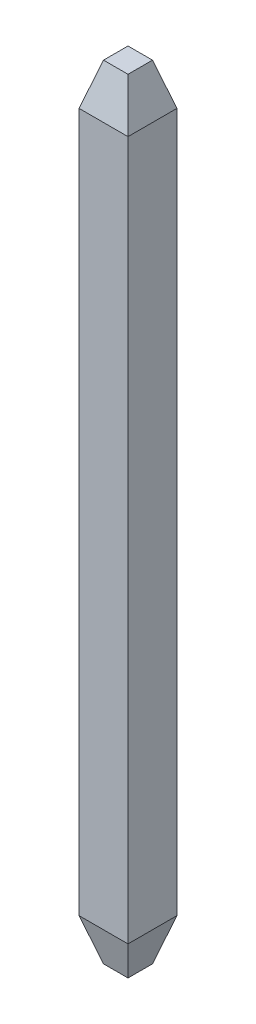
ISO-10303-21;
HEADER;
FILE_DESCRIPTION(('STEP AP214'),'2;1');
FILE_NAME('part.step','',(''),(''),'','','');
FILE_SCHEMA(('AUTOMOTIVE_DESIGN { 1 0 10303 214 1 1 1 1 }'));
ENDSEC;
DATA;
#1=APPLICATION_CONTEXT('core data for automotive mechanical design processes');
#2=APPLICATION_PROTOCOL_DEFINITION('international standard','automotive_design',2000,#1);
#3=PRODUCT_CONTEXT('',#1,'mechanical');
#4=PRODUCT('Part','Part','',(#3));
#5=PRODUCT_RELATED_PRODUCT_CATEGORY('part','',(#4));
#6=PRODUCT_DEFINITION_FORMATION('','',#4);
#7=PRODUCT_DEFINITION_CONTEXT('part definition',#1,'design');
#8=PRODUCT_DEFINITION('design','',#6,#7);
#9=PRODUCT_DEFINITION_SHAPE('','',#8);
#10=(LENGTH_UNIT() NAMED_UNIT(*) SI_UNIT(.MILLI.,.METRE.));
#11=(NAMED_UNIT(*) PLANE_ANGLE_UNIT() SI_UNIT($,.RADIAN.));
#12=(NAMED_UNIT(*) SI_UNIT($,.STERADIAN.) SOLID_ANGLE_UNIT());
#13=UNCERTAINTY_MEASURE_WITH_UNIT(LENGTH_MEASURE(1.E-05),#10,'distance_accuracy_value','');
#14=(GEOMETRIC_REPRESENTATION_CONTEXT(3) GLOBAL_UNCERTAINTY_ASSIGNED_CONTEXT((#13)) GLOBAL_UNIT_ASSIGNED_CONTEXT((#10,
#11,#12)) REPRESENTATION_CONTEXT('',''));
#15=CARTESIAN_POINT('',(0.,0.,0.));
#16=DIRECTION('',(0.,0.,1.));
#17=DIRECTION('',(1.,0.,0.));
#18=AXIS2_PLACEMENT_3D('',#15,#16,#17);
#19=CARTESIAN_POINT('',(-5.86999999998702,-10.1039999999832,-19.5199999999763));
#20=DIRECTION('',(0.959644900900973,-0.281214622974627,0.));
#21=DIRECTION('',(0.,0.,-1.));
#22=AXIS2_PLACEMENT_3D('',#19,#20,#21);
#23=PLANE('',#22);
#24=DIRECTION('',(0.,0.,1.));
#25=VECTOR('',#24,1.);
#26=CARTESIAN_POINT('',(-5.86999999998702,-10.1039999999832,-19.8399999999763));
#27=LINE('',#26,#25);
#28=CARTESIAN_POINT('',(-5.86999999998704,-10.1039999999832,-19.8399999999763));
#29=VERTEX_POINT('',#28);
#30=CARTESIAN_POINT('',(-5.86999999998704,-10.1039999999832,-19.1999999999763));
#31=VERTEX_POINT('',#30);
#32=EDGE_CURVE('E11',#29,#31,#27,.T.);
#33=ORIENTED_EDGE('',*,*,#32,.T.);
#34=DIRECTION('',(-0.270714017147711,-0.923811583516622,-0.270714017147728));
#35=VECTOR('',#34,1.);
#36=CARTESIAN_POINT('',(-5.86999999998702,-10.1039999999832,-19.1999999999763));
#37=LINE('',#36,#35);
#38=CARTESIAN_POINT('',(-6.02999999998704,-10.6499999999832,-19.3599999999763));
#39=VERTEX_POINT('',#38);
#40=EDGE_CURVE('E28',#31,#39,#37,.T.);
#41=ORIENTED_EDGE('',*,*,#40,.T.);
#42=DIRECTION('',(0.,0.,1.));
#43=VECTOR('',#42,1.);
#44=CARTESIAN_POINT('',(-6.02999999998701,-10.6499999999832,-19.6799999999763));
#45=LINE('',#44,#43);
#46=CARTESIAN_POINT('',(-6.02999999998704,-10.6499999999832,-19.6799999999763));
#47=VERTEX_POINT('',#46);
#48=EDGE_CURVE('E105',#47,#39,#45,.T.);
#49=ORIENTED_EDGE('',*,*,#48,.F.);
#50=DIRECTION('',(-0.270714017147711,-0.923811583516622,0.270714017147728));
#51=VECTOR('',#50,1.);
#52=CARTESIAN_POINT('',(-5.86999999998702,-10.1039999999832,-19.8399999999763));
#53=LINE('',#52,#51);
#54=EDGE_CURVE('E101',#29,#47,#53,.T.);
#55=ORIENTED_EDGE('',*,*,#54,.F.);
#56=EDGE_LOOP('',(#33,#41,#49,#55));
#57=FACE_BOUND('',#56,.T.);
#58=ADVANCED_FACE('F17',(#57),#23,.T.);
#59=CARTESIAN_POINT('',(-5.86999999998702,-11.0738701069127,-19.5199999999763));
#60=DIRECTION('',(1.,0.,0.));
#61=DIRECTION('',(0.,1.,0.));
#62=AXIS2_PLACEMENT_3D('',#59,#60,#61);
#63=PLANE('',#62);
#64=DIRECTION('',(0.,1.,0.));
#65=VECTOR('',#64,1.);
#66=CARTESIAN_POINT('',(-5.86999999998702,-10.1039999999832,-19.1999999999763));
#67=LINE('',#66,#65);
#68=CARTESIAN_POINT('',(-5.86999999998704,-0.965870106912691,-19.1999999999763));
#69=VERTEX_POINT('',#68);
#70=EDGE_CURVE('E42',#31,#69,#67,.T.);
#71=ORIENTED_EDGE('',*,*,#70,.F.);
#72=ORIENTED_EDGE('',*,*,#32,.F.);
#73=DIRECTION('',(0.,1.,0.));
#74=VECTOR('',#73,1.);
#75=CARTESIAN_POINT('',(-5.86999999998702,-10.1039999999832,-19.8399999999763));
#76=LINE('',#75,#74);
#77=CARTESIAN_POINT('',(-5.86999999998704,-0.965870106912691,-19.8399999999763));
#78=VERTEX_POINT('',#77);
#79=EDGE_CURVE('E117',#29,#78,#76,.T.);
#80=ORIENTED_EDGE('',*,*,#79,.T.);
#81=DIRECTION('',(0.,0.,1.));
#82=VECTOR('',#81,1.);
#83=CARTESIAN_POINT('',(-5.86999999998702,-0.965870106912693,-19.8399999999763));
#84=LINE('',#83,#82);
#85=EDGE_CURVE('E122',#78,#69,#84,.T.);
#86=ORIENTED_EDGE('',*,*,#85,.T.);
#87=EDGE_LOOP('',(#71,#72,#80,#86));
#88=FACE_BOUND('',#87,.T.);
#89=ADVANCED_FACE('F124',(#88),#63,.T.);
#90=CARTESIAN_POINT('',(-6.51099999998701,-5.53543505344795,-19.1999999999763));
#91=DIRECTION('',(0.,0.,1.));
#92=DIRECTION('',(1.,0.,0.));
#93=AXIS2_PLACEMENT_3D('',#90,#91,#92);
#94=PLANE('',#93);
#95=DIRECTION('',(0.,1.,0.));
#96=VECTOR('',#95,1.);
#97=CARTESIAN_POINT('',(-6.50999999998703,-10.1039999999832,-19.1999999999763));
#98=LINE('',#97,#96);
#99=CARTESIAN_POINT('',(-6.50999999998703,-10.1039999999832,-19.1999999999763));
#100=VERTEX_POINT('',#99);
#101=CARTESIAN_POINT('',(-6.50999999998703,-0.965870106912691,-19.1999999999763));
#102=VERTEX_POINT('',#101);
#103=EDGE_CURVE('E164',#100,#102,#98,.T.);
#104=ORIENTED_EDGE('',*,*,#103,.F.);
#105=DIRECTION('',(-1.,0.,0.));
#106=VECTOR('',#105,1.);
#107=CARTESIAN_POINT('',(-5.86999999998702,-10.1039999999832,-19.1999999999763));
#108=LINE('',#107,#106);
#109=EDGE_CURVE('E147',#31,#100,#108,.T.);
#110=ORIENTED_EDGE('',*,*,#109,.F.);
#111=ORIENTED_EDGE('',*,*,#70,.T.);
#112=DIRECTION('',(-1.,0.,0.));
#113=VECTOR('',#112,1.);
#114=CARTESIAN_POINT('',(-5.86999999998702,-0.965870106912693,-19.1999999999763));
#115=LINE('',#114,#113);
#116=EDGE_CURVE('E200',#69,#102,#115,.T.);
#117=ORIENTED_EDGE('',*,*,#116,.T.);
#118=EDGE_LOOP('',(#104,#110,#111,#117));
#119=FACE_BOUND('',#118,.T.);
#120=ADVANCED_FACE('F218',(#119),#94,.T.);
#121=CARTESIAN_POINT('',(-6.50999999998703,-5.53543505344795,-19.1989999999763));
#122=DIRECTION('',(-1.,0.,0.));
#123=DIRECTION('',(0.,0.,1.));
#124=AXIS2_PLACEMENT_3D('',#121,#122,#123);
#125=PLANE('',#124);
#126=DIRECTION('',(0.,1.,0.));
#127=VECTOR('',#126,1.);
#128=CARTESIAN_POINT('',(-6.50999999998703,-10.1039999999832,-19.8399999999763));
#129=LINE('',#128,#127);
#130=CARTESIAN_POINT('',(-6.50999999998703,-10.1039999999832,-19.8399999999763));
#131=VERTEX_POINT('',#130);
#132=CARTESIAN_POINT('',(-6.50999999998703,-0.965870106912691,-19.8399999999763));
#133=VERTEX_POINT('',#132);
#134=EDGE_CURVE('E136',#131,#133,#129,.T.);
#135=ORIENTED_EDGE('',*,*,#134,.F.);
#136=DIRECTION('',(0.,0.,-1.));
#137=VECTOR('',#136,1.);
#138=CARTESIAN_POINT('',(-6.50999999998703,-10.1039999999832,-19.1999999999763));
#139=LINE('',#138,#137);
#140=EDGE_CURVE('E178',#100,#131,#139,.T.);
#141=ORIENTED_EDGE('',*,*,#140,.F.);
#142=ORIENTED_EDGE('',*,*,#103,.T.);
#143=DIRECTION('',(0.,0.,-1.));
#144=VECTOR('',#143,1.);
#145=CARTESIAN_POINT('',(-6.50999999998703,-0.965870106912693,-19.1999999999763));
#146=LINE('',#145,#144);
#147=EDGE_CURVE('E160',#102,#133,#146,.T.);
#148=ORIENTED_EDGE('',*,*,#147,.T.);
#149=EDGE_LOOP('',(#135,#141,#142,#148));
#150=FACE_BOUND('',#149,.T.);
#151=ADVANCED_FACE('F216',(#150),#125,.T.);
#152=CARTESIAN_POINT('',(-6.50999999998703,-0.965870106912693,-19.5199999999763));
#153=DIRECTION('',(-0.959644900900968,0.281214622974643,0.));
#154=DIRECTION('',(0.,0.,1.));
#155=AXIS2_PLACEMENT_3D('',#152,#153,#154);
#156=PLANE('',#155);
#157=DIRECTION('',(0.270714017147727,0.923811583516618,-0.270714017147727));
#158=VECTOR('',#157,1.);
#159=CARTESIAN_POINT('',(-6.50999999998703,-0.965870106912693,-19.1999999999763));
#160=LINE('',#159,#158);
#161=CARTESIAN_POINT('',(-6.34999999998703,-0.419870106912692,-19.3599999999763));
#162=VERTEX_POINT('',#161);
#163=EDGE_CURVE('E165',#102,#162,#160,.T.);
#164=ORIENTED_EDGE('',*,*,#163,.T.);
#165=DIRECTION('',(0.,0.,-1.));
#166=VECTOR('',#165,1.);
#167=CARTESIAN_POINT('',(-6.34999999998703,-0.419870106912693,-19.3599999999763));
#168=LINE('',#167,#166);
#169=CARTESIAN_POINT('',(-6.34999999998703,-0.419870106912692,-19.6799999999763));
#170=VERTEX_POINT('',#169);
#171=EDGE_CURVE('E140',#162,#170,#168,.T.);
#172=ORIENTED_EDGE('',*,*,#171,.T.);
#173=DIRECTION('',(0.270714017147727,0.923811583516618,0.270714017147727));
#174=VECTOR('',#173,1.);
#175=CARTESIAN_POINT('',(-6.50999999998703,-0.965870106912693,-19.8399999999763));
#176=LINE('',#175,#174);
#177=EDGE_CURVE('E151',#133,#170,#176,.T.);
#178=ORIENTED_EDGE('',*,*,#177,.F.);
#179=ORIENTED_EDGE('',*,*,#147,.F.);
#180=EDGE_LOOP('',(#164,#172,#178,#179));
#181=FACE_BOUND('',#180,.T.);
#182=ADVANCED_FACE('F308',(#181),#156,.T.);
#183=CARTESIAN_POINT('',(-6.18999999998703,-0.965870106912693,-19.8399999999763));
#184=DIRECTION('',(0.,0.281214622974643,-0.959644900900968));
#185=DIRECTION('',(-1.,0.,0.));
#186=AXIS2_PLACEMENT_3D('',#183,#184,#185);
#187=PLANE('',#186);
#188=ORIENTED_EDGE('',*,*,#177,.T.);
#189=DIRECTION('',(1.,0.,0.));
#190=VECTOR('',#189,1.);
#191=CARTESIAN_POINT('',(-6.34999999998703,-0.419870106912693,-19.6799999999763));
#192=LINE('',#191,#190);
#193=CARTESIAN_POINT('',(-6.02999999998704,-0.419870106912692,-19.6799999999763));
#194=VERTEX_POINT('',#193);
#195=EDGE_CURVE('E154',#170,#194,#192,.T.);
#196=ORIENTED_EDGE('',*,*,#195,.T.);
#197=DIRECTION('',(-0.270714017147711,0.923811583516622,0.270714017147728));
#198=VECTOR('',#197,1.);
#199=CARTESIAN_POINT('',(-5.86999999998702,-0.965870106912693,-19.8399999999763));
#200=LINE('',#199,#198);
#201=EDGE_CURVE('E21',#78,#194,#200,.T.);
#202=ORIENTED_EDGE('',*,*,#201,.F.);
#203=DIRECTION('',(1.,0.,0.));
#204=VECTOR('',#203,1.);
#205=CARTESIAN_POINT('',(-6.50999999998703,-0.965870106912693,-19.8399999999763));
#206=LINE('',#205,#204);
#207=EDGE_CURVE('E120',#133,#78,#206,.T.);
#208=ORIENTED_EDGE('',*,*,#207,.F.);
#209=EDGE_LOOP('',(#188,#196,#202,#208));
#210=FACE_BOUND('',#209,.T.);
#211=ADVANCED_FACE('F298',(#210),#187,.T.);
#212=CARTESIAN_POINT('',(-6.18999999998703,-0.419870106912693,-19.6809999999763));
#213=DIRECTION('',(0.,1.,0.));
#214=DIRECTION('',(1.,0.,0.));
#215=AXIS2_PLACEMENT_3D('',#212,#213,#214);
#216=PLANE('',#215);
#217=ORIENTED_EDGE('',*,*,#195,.F.);
#218=ORIENTED_EDGE('',*,*,#171,.F.);
#219=DIRECTION('',(-1.,0.,0.));
#220=VECTOR('',#219,1.);
#221=CARTESIAN_POINT('',(-6.02999999998701,-0.419870106912693,-19.3599999999763));
#222=LINE('',#221,#220);
#223=CARTESIAN_POINT('',(-6.02999999998704,-0.419870106912692,-19.3599999999763));
#224=VERTEX_POINT('',#223);
#225=EDGE_CURVE('E155',#224,#162,#222,.T.);
#226=ORIENTED_EDGE('',*,*,#225,.F.);
#227=DIRECTION('',(0.,0.,1.));
#228=VECTOR('',#227,1.);
#229=CARTESIAN_POINT('',(-6.02999999998701,-0.419870106912693,-19.6799999999763));
#230=LINE('',#229,#228);
#231=EDGE_CURVE('E168',#194,#224,#230,.T.);
#232=ORIENTED_EDGE('',*,*,#231,.F.);
#233=EDGE_LOOP('',(#217,#218,#226,#232));
#234=FACE_BOUND('',#233,.T.);
#235=ADVANCED_FACE('F293',(#234),#216,.T.);
#236=CARTESIAN_POINT('',(-6.50999999998703,-10.1039999999832,-19.5199999999763));
#237=DIRECTION('',(-0.959644900900968,-0.281214622974643,0.));
#238=DIRECTION('',(-0.281214622974643,0.959644900900968,0.));
#239=AXIS2_PLACEMENT_3D('',#236,#237,#238);
#240=PLANE('',#239);
#241=ORIENTED_EDGE('',*,*,#140,.T.);
#242=DIRECTION('',(0.270714017147727,-0.923811583516618,0.270714017147727));
#243=VECTOR('',#242,1.);
#244=CARTESIAN_POINT('',(-6.50999999998703,-10.1039999999832,-19.8399999999763));
#245=LINE('',#244,#243);
#246=CARTESIAN_POINT('',(-6.34999999998703,-10.6499999999832,-19.6799999999763));
#247=VERTEX_POINT('',#246);
#248=EDGE_CURVE('E128',#131,#247,#245,.T.);
#249=ORIENTED_EDGE('',*,*,#248,.T.);
#250=DIRECTION('',(0.,0.,-1.));
#251=VECTOR('',#250,1.);
#252=CARTESIAN_POINT('',(-6.34999999998703,-10.6499999999832,-19.3599999999763));
#253=LINE('',#252,#251);
#254=CARTESIAN_POINT('',(-6.34999999998703,-10.6499999999832,-19.3599999999763));
#255=VERTEX_POINT('',#254);
#256=EDGE_CURVE('E169',#255,#247,#253,.T.);
#257=ORIENTED_EDGE('',*,*,#256,.F.);
#258=DIRECTION('',(0.270714017147727,-0.923811583516618,-0.270714017147727));
#259=VECTOR('',#258,1.);
#260=CARTESIAN_POINT('',(-6.50999999998703,-10.1039999999832,-19.1999999999763));
#261=LINE('',#260,#259);
#262=EDGE_CURVE('E144',#100,#255,#261,.T.);
#263=ORIENTED_EDGE('',*,*,#262,.F.);
#264=EDGE_LOOP('',(#241,#249,#257,#263));
#265=FACE_BOUND('',#264,.T.);
#266=ADVANCED_FACE('F211',(#265),#240,.T.);
#267=CARTESIAN_POINT('',(-6.18999999998703,-0.965870106912693,-19.1999999999763));
#268=DIRECTION('',(0.,0.281214622974643,0.959644900900968));
#269=DIRECTION('',(1.,0.,0.));
#270=AXIS2_PLACEMENT_3D('',#267,#268,#269);
#271=PLANE('',#270);
#272=DIRECTION('',(-0.270714017147711,0.923811583516622,-0.270714017147728));
#273=VECTOR('',#272,1.);
#274=CARTESIAN_POINT('',(-5.86999999998702,-0.965870106912693,-19.1999999999763));
#275=LINE('',#274,#273);
#276=EDGE_CURVE('E159',#69,#224,#275,.T.);
#277=ORIENTED_EDGE('',*,*,#276,.T.);
#278=ORIENTED_EDGE('',*,*,#225,.T.);
#279=ORIENTED_EDGE('',*,*,#163,.F.);
#280=ORIENTED_EDGE('',*,*,#116,.F.);
#281=EDGE_LOOP('',(#277,#278,#279,#280));
#282=FACE_BOUND('',#281,.T.);
#283=ADVANCED_FACE('F19',(#282),#271,.T.);
#284=CARTESIAN_POINT('',(-5.86999999998702,-0.965870106912693,-19.5199999999763));
#285=DIRECTION('',(0.959644900900973,0.281214622974627,0.));
#286=DIRECTION('',(0.,0.,-1.));
#287=AXIS2_PLACEMENT_3D('',#284,#285,#286);
#288=PLANE('',#287);
#289=ORIENTED_EDGE('',*,*,#201,.T.);
#290=ORIENTED_EDGE('',*,*,#231,.T.);
#291=ORIENTED_EDGE('',*,*,#276,.F.);
#292=ORIENTED_EDGE('',*,*,#85,.F.);
#293=EDGE_LOOP('',(#289,#290,#291,#292));
#294=FACE_BOUND('',#293,.T.);
#295=ADVANCED_FACE('F323',(#294),#288,.T.);
#296=CARTESIAN_POINT('',(-5.86899999998701,-5.53443505344795,-19.8399999999763));
#297=DIRECTION('',(0.,0.,-1.));
#298=DIRECTION('',(0.,-1.,0.));
#299=AXIS2_PLACEMENT_3D('',#296,#297,#298);
#300=PLANE('',#299);
#301=ORIENTED_EDGE('',*,*,#79,.F.);
#302=DIRECTION('',(1.,0.,0.));
#303=VECTOR('',#302,1.);
#304=CARTESIAN_POINT('',(-6.50999999998703,-10.1039999999832,-19.8399999999763));
#305=LINE('',#304,#303);
#306=EDGE_CURVE('E111',#131,#29,#305,.T.);
#307=ORIENTED_EDGE('',*,*,#306,.F.);
#308=ORIENTED_EDGE('',*,*,#134,.T.);
#309=ORIENTED_EDGE('',*,*,#207,.T.);
#310=EDGE_LOOP('',(#301,#307,#308,#309));
#311=FACE_BOUND('',#310,.T.);
#312=ADVANCED_FACE('F118',(#311),#300,.T.);
#313=CARTESIAN_POINT('',(-6.18999999998703,-10.1039999999832,-19.8399999999763));
#314=DIRECTION('',(0.,-0.281214622974643,-0.959644900900968));
#315=DIRECTION('',(0.,-0.959644900900968,0.281214622974643));
#316=AXIS2_PLACEMENT_3D('',#313,#314,#315);
#317=PLANE('',#316);
#318=ORIENTED_EDGE('',*,*,#306,.T.);
#319=ORIENTED_EDGE('',*,*,#54,.T.);
#320=DIRECTION('',(1.,0.,0.));
#321=VECTOR('',#320,1.);
#322=CARTESIAN_POINT('',(-6.34999999998703,-10.6499999999832,-19.6799999999763));
#323=LINE('',#322,#321);
#324=EDGE_CURVE('E149',#247,#47,#323,.T.);
#325=ORIENTED_EDGE('',*,*,#324,.F.);
#326=ORIENTED_EDGE('',*,*,#248,.F.);
#327=EDGE_LOOP('',(#318,#319,#325,#326));
#328=FACE_BOUND('',#327,.T.);
#329=ADVANCED_FACE('F126',(#328),#317,.T.);
#330=CARTESIAN_POINT('',(-6.35099999998701,-10.6499999999832,-19.5199999999763));
#331=DIRECTION('',(0.,-1.,0.));
#332=DIRECTION('',(0.,0.,-1.));
#333=AXIS2_PLACEMENT_3D('',#330,#331,#332);
#334=PLANE('',#333);
#335=ORIENTED_EDGE('',*,*,#48,.T.);
#336=DIRECTION('',(-1.,0.,0.));
#337=VECTOR('',#336,1.);
#338=CARTESIAN_POINT('',(-6.02999999998701,-10.6499999999832,-19.3599999999763));
#339=LINE('',#338,#337);
#340=EDGE_CURVE('E171',#39,#255,#339,.T.);
#341=ORIENTED_EDGE('',*,*,#340,.T.);
#342=ORIENTED_EDGE('',*,*,#256,.T.);
#343=ORIENTED_EDGE('',*,*,#324,.T.);
#344=EDGE_LOOP('',(#335,#341,#342,#343));
#345=FACE_BOUND('',#344,.T.);
#346=ADVANCED_FACE('F334',(#345),#334,.T.);
#347=CARTESIAN_POINT('',(-6.18999999998703,-10.1039999999832,-19.1999999999763));
#348=DIRECTION('',(0.,-0.281214622974643,0.959644900900968));
#349=DIRECTION('',(-1.,0.,0.));
#350=AXIS2_PLACEMENT_3D('',#347,#348,#349);
#351=PLANE('',#350);
#352=ORIENTED_EDGE('',*,*,#109,.T.);
#353=ORIENTED_EDGE('',*,*,#262,.T.);
#354=ORIENTED_EDGE('',*,*,#340,.F.);
#355=ORIENTED_EDGE('',*,*,#40,.F.);
#356=EDGE_LOOP('',(#352,#353,#354,#355));
#357=FACE_BOUND('',#356,.T.);
#358=ADVANCED_FACE('F339',(#357),#351,.T.);
#359=CLOSED_SHELL('',(#58,#89,#120,#151,#182,#211,#235,#266,#283,#295,#312,#329,#346,#358));
#360=MANIFOLD_SOLID_BREP('B1',#359);
#361=ADVANCED_BREP_SHAPE_REPRESENTATION('',(#18,#360),#14);
#362=SHAPE_DEFINITION_REPRESENTATION(#9,#361);
ENDSEC;
END-ISO-10303-21;
